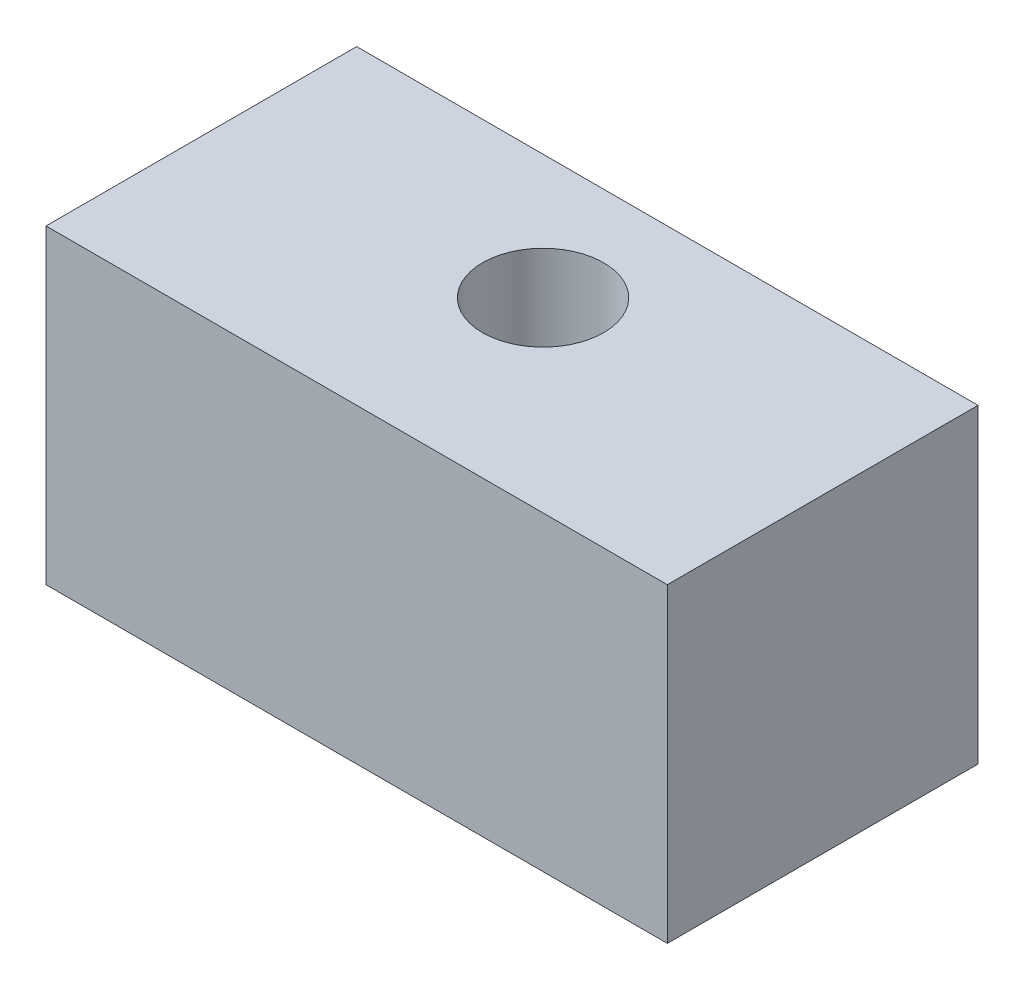
ISO-10303-21;
HEADER;
FILE_DESCRIPTION(('STEP AP214'),'2;1');
FILE_NAME('part.step','',(''),(''),'','','');
FILE_SCHEMA(('AUTOMOTIVE_DESIGN { 1 0 10303 214 1 1 1 1 }'));
ENDSEC;
DATA;
#1=APPLICATION_CONTEXT('core data for automotive mechanical design processes');
#2=APPLICATION_PROTOCOL_DEFINITION('international standard','automotive_design',2000,#1);
#3=PRODUCT_CONTEXT('',#1,'mechanical');
#4=PRODUCT('Part','Part','',(#3));
#5=PRODUCT_RELATED_PRODUCT_CATEGORY('part','',(#4));
#6=PRODUCT_DEFINITION_FORMATION('','',#4);
#7=PRODUCT_DEFINITION_CONTEXT('part definition',#1,'design');
#8=PRODUCT_DEFINITION('design','',#6,#7);
#9=PRODUCT_DEFINITION_SHAPE('','',#8);
#10=(LENGTH_UNIT() NAMED_UNIT(*) SI_UNIT(.MILLI.,.METRE.));
#11=(NAMED_UNIT(*) PLANE_ANGLE_UNIT() SI_UNIT($,.RADIAN.));
#12=(NAMED_UNIT(*) SI_UNIT($,.STERADIAN.) SOLID_ANGLE_UNIT());
#13=UNCERTAINTY_MEASURE_WITH_UNIT(LENGTH_MEASURE(1.E-05),#10,'distance_accuracy_value','');
#14=(GEOMETRIC_REPRESENTATION_CONTEXT(3) GLOBAL_UNCERTAINTY_ASSIGNED_CONTEXT((#13)) GLOBAL_UNIT_ASSIGNED_CONTEXT((#10,
#11,#12)) REPRESENTATION_CONTEXT('',''));
#15=CARTESIAN_POINT('',(0.,0.,0.));
#16=DIRECTION('',(0.,0.,1.));
#17=DIRECTION('',(1.,0.,0.));
#18=AXIS2_PLACEMENT_3D('',#15,#16,#17);
#19=CARTESIAN_POINT('',(10.,10.,-5.));
#20=DIRECTION('',(-1.,0.,0.));
#21=DIRECTION('',(0.,0.,1.));
#22=AXIS2_PLACEMENT_3D('',#19,#20,#21);
#23=PLANE('',#22);
#24=DIRECTION('',(0.,0.,-1.));
#25=VECTOR('',#24,1.);
#26=CARTESIAN_POINT('',(10.,0.,-5.));
#27=LINE('',#26,#25);
#28=CARTESIAN_POINT('',(10.,0.,5.));
#29=VERTEX_POINT('',#28);
#30=CARTESIAN_POINT('',(10.,0.,-5.));
#31=VERTEX_POINT('',#30);
#32=EDGE_CURVE('E107',#29,#31,#27,.T.);
#33=ORIENTED_EDGE('',*,*,#32,.T.);
#34=DIRECTION('',(0.,-1.,0.));
#35=VECTOR('',#34,1.);
#36=CARTESIAN_POINT('',(10.,10.,-5.));
#37=LINE('',#36,#35);
#38=CARTESIAN_POINT('',(10.,10.,-5.));
#39=VERTEX_POINT('',#38);
#40=EDGE_CURVE('E11',#39,#31,#37,.T.);
#41=ORIENTED_EDGE('',*,*,#40,.F.);
#42=DIRECTION('',(0.,0.,-1.));
#43=VECTOR('',#42,1.);
#44=CARTESIAN_POINT('',(10.,10.,-5.));
#45=LINE('',#44,#43);
#46=CARTESIAN_POINT('',(10.,10.,5.));
#47=VERTEX_POINT('',#46);
#48=EDGE_CURVE('E91',#47,#39,#45,.T.);
#49=ORIENTED_EDGE('',*,*,#48,.F.);
#50=DIRECTION('',(0.,-1.,0.));
#51=VECTOR('',#50,1.);
#52=CARTESIAN_POINT('',(10.,10.,5.));
#53=LINE('',#52,#51);
#54=EDGE_CURVE('E103',#47,#29,#53,.T.);
#55=ORIENTED_EDGE('',*,*,#54,.T.);
#56=EDGE_LOOP('',(#33,#41,#49,#55));
#57=FACE_BOUND('',#56,.T.);
#58=ADVANCED_FACE('F39',(#57),#23,.F.);
#59=CARTESIAN_POINT('',(-10.,10.,-5.));
#60=DIRECTION('',(0.,0.,1.));
#61=DIRECTION('',(1.,0.,0.));
#62=AXIS2_PLACEMENT_3D('',#59,#60,#61);
#63=PLANE('',#62);
#64=DIRECTION('',(-1.,0.,0.));
#65=VECTOR('',#64,1.);
#66=CARTESIAN_POINT('',(-10.,0.,-5.));
#67=LINE('',#66,#65);
#68=CARTESIAN_POINT('',(-10.,0.,-5.));
#69=VERTEX_POINT('',#68);
#70=EDGE_CURVE('E96',#31,#69,#67,.T.);
#71=ORIENTED_EDGE('',*,*,#70,.T.);
#72=DIRECTION('',(0.,-1.,0.));
#73=VECTOR('',#72,1.);
#74=CARTESIAN_POINT('',(-10.,10.,-5.));
#75=LINE('',#74,#73);
#76=CARTESIAN_POINT('',(-10.,10.,-5.));
#77=VERTEX_POINT('',#76);
#78=EDGE_CURVE('E48',#77,#69,#75,.T.);
#79=ORIENTED_EDGE('',*,*,#78,.F.);
#80=DIRECTION('',(-1.,0.,0.));
#81=VECTOR('',#80,1.);
#82=CARTESIAN_POINT('',(-10.,10.,-5.));
#83=LINE('',#82,#81);
#84=EDGE_CURVE('E86',#39,#77,#83,.T.);
#85=ORIENTED_EDGE('',*,*,#84,.F.);
#86=ORIENTED_EDGE('',*,*,#40,.T.);
#87=EDGE_LOOP('',(#71,#79,#85,#86));
#88=FACE_BOUND('',#87,.T.);
#89=ADVANCED_FACE('F95',(#88),#63,.F.);
#90=CARTESIAN_POINT('',(-10.,10.,-5.));
#91=DIRECTION('',(1.,0.,0.));
#92=DIRECTION('',(0.,0.,-1.));
#93=AXIS2_PLACEMENT_3D('',#90,#91,#92);
#94=PLANE('',#93);
#95=DIRECTION('',(0.,0.,1.));
#96=VECTOR('',#95,1.);
#97=CARTESIAN_POINT('',(-10.,0.,-5.));
#98=LINE('',#97,#96);
#99=CARTESIAN_POINT('',(-10.,0.,5.));
#100=VERTEX_POINT('',#99);
#101=EDGE_CURVE('E73',#69,#100,#98,.T.);
#102=ORIENTED_EDGE('',*,*,#101,.T.);
#103=DIRECTION('',(0.,-1.,0.));
#104=VECTOR('',#103,1.);
#105=CARTESIAN_POINT('',(-10.,10.,5.));
#106=LINE('',#105,#104);
#107=CARTESIAN_POINT('',(-10.,10.,5.));
#108=VERTEX_POINT('',#107);
#109=EDGE_CURVE('E98',#108,#100,#106,.T.);
#110=ORIENTED_EDGE('',*,*,#109,.F.);
#111=DIRECTION('',(0.,0.,1.));
#112=VECTOR('',#111,1.);
#113=CARTESIAN_POINT('',(-10.,10.,-5.));
#114=LINE('',#113,#112);
#115=EDGE_CURVE('E89',#77,#108,#114,.T.);
#116=ORIENTED_EDGE('',*,*,#115,.F.);
#117=ORIENTED_EDGE('',*,*,#78,.T.);
#118=EDGE_LOOP('',(#102,#110,#116,#117));
#119=FACE_BOUND('',#118,.T.);
#120=ADVANCED_FACE('F99',(#119),#94,.F.);
#121=CARTESIAN_POINT('',(-10.,10.,5.));
#122=DIRECTION('',(0.,0.,-1.));
#123=DIRECTION('',(-1.,0.,0.));
#124=AXIS2_PLACEMENT_3D('',#121,#122,#123);
#125=PLANE('',#124);
#126=DIRECTION('',(1.,0.,0.));
#127=VECTOR('',#126,1.);
#128=CARTESIAN_POINT('',(-10.,0.,5.));
#129=LINE('',#128,#127);
#130=EDGE_CURVE('E79',#100,#29,#129,.T.);
#131=ORIENTED_EDGE('',*,*,#130,.T.);
#132=ORIENTED_EDGE('',*,*,#54,.F.);
#133=DIRECTION('',(1.,0.,0.));
#134=VECTOR('',#133,1.);
#135=CARTESIAN_POINT('',(-10.,10.,5.));
#136=LINE('',#135,#134);
#137=EDGE_CURVE('E56',#108,#47,#136,.T.);
#138=ORIENTED_EDGE('',*,*,#137,.F.);
#139=ORIENTED_EDGE('',*,*,#109,.T.);
#140=EDGE_LOOP('',(#131,#132,#138,#139));
#141=FACE_BOUND('',#140,.T.);
#142=ADVANCED_FACE('F121',(#141),#125,.F.);
#143=CARTESIAN_POINT('',(0.,10.,0.));
#144=DIRECTION('',(0.,1.,0.));
#145=DIRECTION('',(0.,0.,1.));
#146=AXIS2_PLACEMENT_3D('',#143,#144,#145);
#147=PLANE('',#146);
#148=CARTESIAN_POINT('',(0.,10.,-1.));
#149=DIRECTION('',(0.,1.,0.));
#150=DIRECTION('',(0.,0.,1.));
#151=AXIS2_PLACEMENT_3D('',#148,#149,#150);
#152=CIRCLE('',#151,1.95);
#153=CARTESIAN_POINT('',(0.,10.,0.950000000000001));
#154=VERTEX_POINT('',#153);
#155=EDGE_CURVE('E128',#154,#154,#152,.T.);
#156=ORIENTED_EDGE('',*,*,#155,.F.);
#157=EDGE_LOOP('',(#156));
#158=FACE_BOUND('',#157,.T.);
#159=ORIENTED_EDGE('',*,*,#48,.T.);
#160=ORIENTED_EDGE('',*,*,#84,.T.);
#161=ORIENTED_EDGE('',*,*,#115,.T.);
#162=ORIENTED_EDGE('',*,*,#137,.T.);
#163=EDGE_LOOP('',(#159,#160,#161,#162));
#164=FACE_BOUND('',#163,.T.);
#165=ADVANCED_FACE('F87',(#158,#164),#147,.T.);
#166=CARTESIAN_POINT('',(0.,0.,0.));
#167=DIRECTION('',(0.,1.,0.));
#168=DIRECTION('',(0.,0.,1.));
#169=AXIS2_PLACEMENT_3D('',#166,#167,#168);
#170=PLANE('',#169);
#171=CARTESIAN_POINT('',(0.,0.,-1.));
#172=DIRECTION('',(0.,1.,0.));
#173=DIRECTION('',(0.,0.,1.));
#174=AXIS2_PLACEMENT_3D('',#171,#172,#173);
#175=CIRCLE('',#174,1.95);
#176=CARTESIAN_POINT('',(0.,0.,0.950000000000001));
#177=VERTEX_POINT('',#176);
#178=EDGE_CURVE('E111',#177,#177,#175,.T.);
#179=ORIENTED_EDGE('',*,*,#178,.T.);
#180=EDGE_LOOP('',(#179));
#181=FACE_BOUND('',#180,.T.);
#182=ORIENTED_EDGE('',*,*,#32,.F.);
#183=ORIENTED_EDGE('',*,*,#130,.F.);
#184=ORIENTED_EDGE('',*,*,#101,.F.);
#185=ORIENTED_EDGE('',*,*,#70,.F.);
#186=EDGE_LOOP('',(#182,#183,#184,#185));
#187=FACE_BOUND('',#186,.T.);
#188=ADVANCED_FACE('F124',(#181,#187),#170,.F.);
#189=CARTESIAN_POINT('',(0.,0.,-1.));
#190=DIRECTION('',(0.,1.,0.));
#191=DIRECTION('',(0.,0.,1.));
#192=AXIS2_PLACEMENT_3D('',#189,#190,#191);
#193=CYLINDRICAL_SURFACE('',#192,1.95);
#194=ORIENTED_EDGE('',*,*,#178,.F.);
#195=EDGE_LOOP('',(#194));
#196=FACE_BOUND('',#195,.T.);
#197=ORIENTED_EDGE('',*,*,#155,.T.);
#198=EDGE_LOOP('',(#197));
#199=FACE_BOUND('',#198,.T.);
#200=ADVANCED_FACE('F137',(#196,#199),#193,.F.);
#201=CLOSED_SHELL('',(#58,#89,#120,#142,#165,#188,#200));
#202=MANIFOLD_SOLID_BREP('B2',#201);
#203=ADVANCED_BREP_SHAPE_REPRESENTATION('',(#18,#202),#14);
#204=SHAPE_DEFINITION_REPRESENTATION(#9,#203);
ENDSEC;
END-ISO-10303-21;
